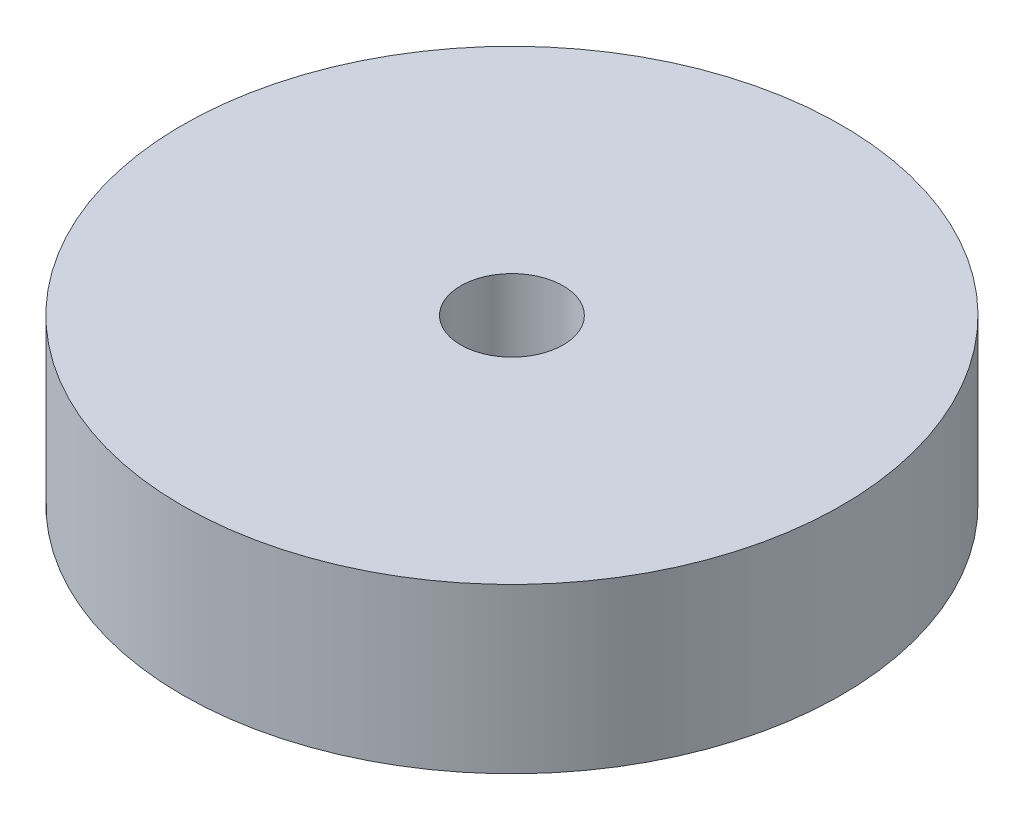
ISO-10303-21;
HEADER;
FILE_DESCRIPTION(('STEP AP214'),'2;1');
FILE_NAME('part.step','',(''),(''),'','','');
FILE_SCHEMA(('AUTOMOTIVE_DESIGN { 1 0 10303 214 1 1 1 1 }'));
ENDSEC;
DATA;
#1=APPLICATION_CONTEXT('core data for automotive mechanical design processes');
#2=APPLICATION_PROTOCOL_DEFINITION('international standard','automotive_design',2000,#1);
#3=PRODUCT_CONTEXT('',#1,'mechanical');
#4=PRODUCT('Part','Part','',(#3));
#5=PRODUCT_RELATED_PRODUCT_CATEGORY('part','',(#4));
#6=PRODUCT_DEFINITION_FORMATION('','',#4);
#7=PRODUCT_DEFINITION_CONTEXT('part definition',#1,'design');
#8=PRODUCT_DEFINITION('design','',#6,#7);
#9=PRODUCT_DEFINITION_SHAPE('','',#8);
#10=(LENGTH_UNIT() NAMED_UNIT(*) SI_UNIT(.MILLI.,.METRE.));
#11=(NAMED_UNIT(*) PLANE_ANGLE_UNIT() SI_UNIT($,.RADIAN.));
#12=(NAMED_UNIT(*) SI_UNIT($,.STERADIAN.) SOLID_ANGLE_UNIT());
#13=UNCERTAINTY_MEASURE_WITH_UNIT(LENGTH_MEASURE(1.E-05),#10,'distance_accuracy_value','');
#14=(GEOMETRIC_REPRESENTATION_CONTEXT(3) GLOBAL_UNCERTAINTY_ASSIGNED_CONTEXT((#13)) GLOBAL_UNIT_ASSIGNED_CONTEXT((#10,
#11,#12)) REPRESENTATION_CONTEXT('',''));
#15=CARTESIAN_POINT('',(0.,0.,0.));
#16=DIRECTION('',(0.,0.,1.));
#17=DIRECTION('',(1.,0.,0.));
#18=AXIS2_PLACEMENT_3D('',#15,#16,#17);
#19=CARTESIAN_POINT('',(0.,0.,0.));
#20=DIRECTION('',(0.,1.,0.));
#21=DIRECTION('',(0.,0.,1.));
#22=AXIS2_PLACEMENT_3D('',#19,#20,#21);
#23=CYLINDRICAL_SURFACE('',#22,1.5875);
#24=CARTESIAN_POINT('',(0.,0.,0.));
#25=DIRECTION('',(0.,1.,0.));
#26=DIRECTION('',(0.,0.,1.));
#27=AXIS2_PLACEMENT_3D('',#24,#25,#26);
#28=CIRCLE('',#27,1.5875);
#29=CARTESIAN_POINT('',(0.,0.,1.5875));
#30=VERTEX_POINT('',#29);
#31=EDGE_CURVE('E54',#30,#30,#28,.T.);
#32=ORIENTED_EDGE('',*,*,#31,.T.);
#33=EDGE_LOOP('',(#32));
#34=FACE_BOUND('',#33,.T.);
#35=CARTESIAN_POINT('',(0.,-5.08,0.));
#36=DIRECTION('',(0.,1.,0.));
#37=DIRECTION('',(0.,0.,1.));
#38=AXIS2_PLACEMENT_3D('',#35,#36,#37);
#39=CIRCLE('',#38,1.5875);
#40=CARTESIAN_POINT('',(0.,-5.08,1.5875));
#41=VERTEX_POINT('',#40);
#42=EDGE_CURVE('E10',#41,#41,#39,.T.);
#43=ORIENTED_EDGE('',*,*,#42,.F.);
#44=EDGE_LOOP('',(#43));
#45=FACE_BOUND('',#44,.T.);
#46=ADVANCED_FACE('F37',(#34,#45),#23,.F.);
#47=CARTESIAN_POINT('',(-1.5875,-5.08,0.));
#48=DIRECTION('',(0.,-1.,0.));
#49=DIRECTION('',(0.,0.,-1.));
#50=AXIS2_PLACEMENT_3D('',#47,#48,#49);
#51=PLANE('',#50);
#52=ORIENTED_EDGE('',*,*,#42,.T.);
#53=EDGE_LOOP('',(#52));
#54=FACE_BOUND('',#53,.T.);
#55=CARTESIAN_POINT('',(0.,-5.08,0.));
#56=DIRECTION('',(0.,1.,0.));
#57=DIRECTION('',(0.,0.,1.));
#58=AXIS2_PLACEMENT_3D('',#55,#56,#57);
#59=CIRCLE('',#58,10.2108);
#60=CARTESIAN_POINT('',(0.,-5.08,10.2108));
#61=VERTEX_POINT('',#60);
#62=EDGE_CURVE('E44',#61,#61,#59,.T.);
#63=ORIENTED_EDGE('',*,*,#62,.F.);
#64=EDGE_LOOP('',(#63));
#65=FACE_BOUND('',#64,.T.);
#66=ADVANCED_FACE('F71',(#54,#65),#51,.T.);
#67=CARTESIAN_POINT('',(0.,0.,0.));
#68=DIRECTION('',(0.,1.,0.));
#69=DIRECTION('',(0.,0.,1.));
#70=AXIS2_PLACEMENT_3D('',#67,#68,#69);
#71=CYLINDRICAL_SURFACE('',#70,10.2108);
#72=ORIENTED_EDGE('',*,*,#62,.T.);
#73=EDGE_LOOP('',(#72));
#74=FACE_BOUND('',#73,.T.);
#75=CARTESIAN_POINT('',(0.,0.,0.));
#76=DIRECTION('',(0.,1.,0.));
#77=DIRECTION('',(0.,0.,1.));
#78=AXIS2_PLACEMENT_3D('',#75,#76,#77);
#79=CIRCLE('',#78,10.2108);
#80=CARTESIAN_POINT('',(0.,0.,10.2108));
#81=VERTEX_POINT('',#80);
#82=EDGE_CURVE('E49',#81,#81,#79,.T.);
#83=ORIENTED_EDGE('',*,*,#82,.F.);
#84=EDGE_LOOP('',(#83));
#85=FACE_BOUND('',#84,.T.);
#86=ADVANCED_FACE('F65',(#74,#85),#71,.T.);
#87=CARTESIAN_POINT('',(-1.5875,0.,0.));
#88=DIRECTION('',(0.,1.,0.));
#89=DIRECTION('',(0.,0.,1.));
#90=AXIS2_PLACEMENT_3D('',#87,#88,#89);
#91=PLANE('',#90);
#92=ORIENTED_EDGE('',*,*,#82,.T.);
#93=EDGE_LOOP('',(#92));
#94=FACE_BOUND('',#93,.T.);
#95=ORIENTED_EDGE('',*,*,#31,.F.);
#96=EDGE_LOOP('',(#95));
#97=FACE_BOUND('',#96,.T.);
#98=ADVANCED_FACE('F63',(#94,#97),#91,.T.);
#99=CLOSED_SHELL('',(#46,#66,#86,#98));
#100=MANIFOLD_SOLID_BREP('B2',#99);
#101=ADVANCED_BREP_SHAPE_REPRESENTATION('',(#18,#100),#14);
#102=SHAPE_DEFINITION_REPRESENTATION(#9,#101);
ENDSEC;
END-ISO-10303-21;
